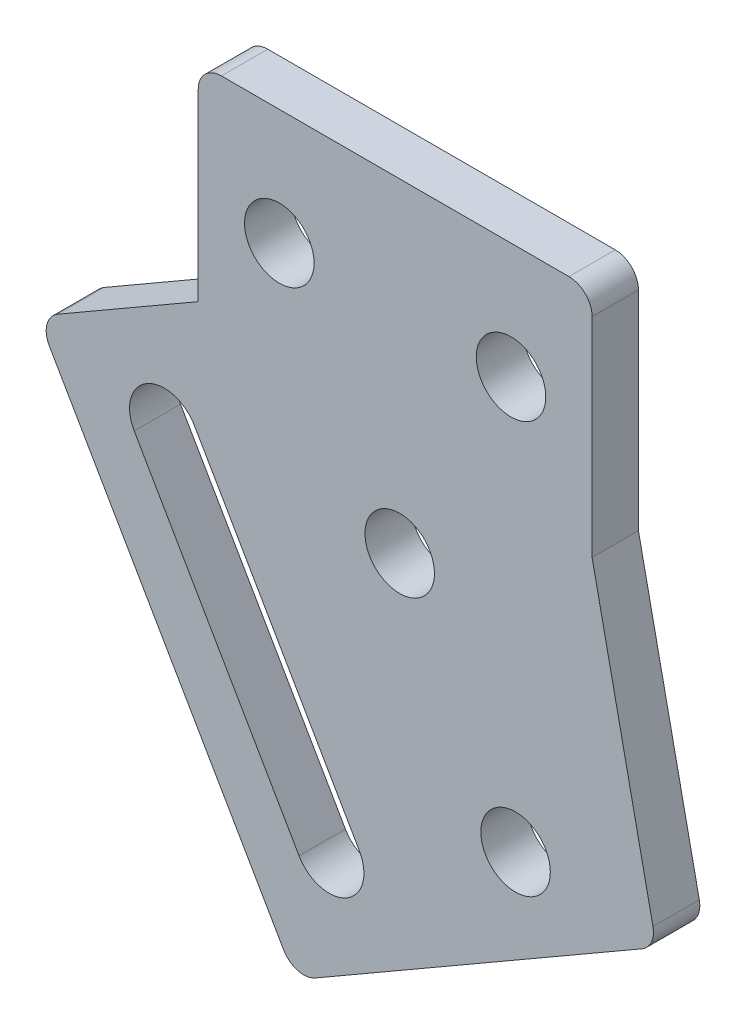
ISO-10303-21;
HEADER;
FILE_DESCRIPTION(('STEP AP214'),'2;1');
FILE_NAME('part.step','',(''),(''),'','','');
FILE_SCHEMA(('AUTOMOTIVE_DESIGN { 1 0 10303 214 1 1 1 1 }'));
ENDSEC;
DATA;
#1=APPLICATION_CONTEXT('core data for automotive mechanical design processes');
#2=APPLICATION_PROTOCOL_DEFINITION('international standard','automotive_design',2000,#1);
#3=PRODUCT_CONTEXT('',#1,'mechanical');
#4=PRODUCT('Part','Part','',(#3));
#5=PRODUCT_RELATED_PRODUCT_CATEGORY('part','',(#4));
#6=PRODUCT_DEFINITION_FORMATION('','',#4);
#7=PRODUCT_DEFINITION_CONTEXT('part definition',#1,'design');
#8=PRODUCT_DEFINITION('design','',#6,#7);
#9=PRODUCT_DEFINITION_SHAPE('','',#8);
#10=(LENGTH_UNIT() NAMED_UNIT(*) SI_UNIT(.MILLI.,.METRE.));
#11=(NAMED_UNIT(*) PLANE_ANGLE_UNIT() SI_UNIT($,.RADIAN.));
#12=(NAMED_UNIT(*) SI_UNIT($,.STERADIAN.) SOLID_ANGLE_UNIT());
#13=UNCERTAINTY_MEASURE_WITH_UNIT(LENGTH_MEASURE(1.E-05),#10,'distance_accuracy_value','');
#14=(GEOMETRIC_REPRESENTATION_CONTEXT(3) GLOBAL_UNCERTAINTY_ASSIGNED_CONTEXT((#13)) GLOBAL_UNIT_ASSIGNED_CONTEXT((#10,
#11,#12)) REPRESENTATION_CONTEXT('',''));
#15=CARTESIAN_POINT('',(0.,0.,0.));
#16=DIRECTION('',(0.,0.,1.));
#17=DIRECTION('',(1.,0.,0.));
#18=AXIS2_PLACEMENT_3D('',#15,#16,#17);
#19=CARTESIAN_POINT('',(0.,0.,2.));
#20=DIRECTION('',(0.,0.,-1.));
#21=DIRECTION('',(-1.,0.,0.));
#22=AXIS2_PLACEMENT_3D('',#19,#20,#21);
#23=PLANE('',#22);
#24=DIRECTION('',(0.5,-0.866025403784439,0.));
#25=VECTOR('',#24,1.);
#26=CARTESIAN_POINT('',(-18.7852540378781,-10.8456714755644,2.));
#27=LINE('',#26,#25);
#28=CARTESIAN_POINT('',(-17.1650635094611,-13.6519237887245,2.));
#29=VERTEX_POINT('',#28);
#30=CARTESIAN_POINT('',(-10.0490381056317,-25.9772413361079,2.));
#31=VERTEX_POINT('',#30);
#32=EDGE_CURVE('E192',#29,#31,#27,.T.);
#33=ORIENTED_EDGE('',*,*,#32,.T.);
#34=CARTESIAN_POINT('',(-11.3480762113083,-26.7272413361079,2.));
#35=DIRECTION('',(0.,0.,-1.));
#36=DIRECTION('',(-1.,0.,0.));
#37=AXIS2_PLACEMENT_3D('',#34,#35,#36);
#38=CIRCLE('',#37,1.5);
#39=CARTESIAN_POINT('',(-12.647114316985,-27.4772413361079,2.));
#40=VERTEX_POINT('',#39);
#41=EDGE_CURVE('E195',#31,#40,#38,.T.);
#42=ORIENTED_EDGE('',*,*,#41,.T.);
#43=DIRECTION('',(-0.5,0.866025403784438,0.));
#44=VECTOR('',#43,1.);
#45=CARTESIAN_POINT('',(-21.3833302492314,-12.3456714755644,2.));
#46=LINE('',#45,#44);
#47=CARTESIAN_POINT('',(-19.7631397208144,-15.1519237887245,2.));
#48=VERTEX_POINT('',#47);
#49=EDGE_CURVE('E187',#40,#48,#46,.T.);
#50=ORIENTED_EDGE('',*,*,#49,.T.);
#51=CARTESIAN_POINT('',(-18.4641016151378,-14.4019237887245,2.));
#52=DIRECTION('',(0.,0.,-1.));
#53=DIRECTION('',(-1.,0.,0.));
#54=AXIS2_PLACEMENT_3D('',#51,#52,#53);
#55=CIRCLE('',#54,1.5);
#56=EDGE_CURVE('E162',#48,#29,#55,.T.);
#57=ORIENTED_EDGE('',*,*,#56,.T.);
#58=EDGE_LOOP('',(#33,#42,#50,#57));
#59=FACE_BOUND('',#58,.T.);
#60=DIRECTION('',(0.866025403784436,0.500000000000004,0.));
#61=VECTOR('',#60,1.);
#62=CARTESIAN_POINT('',(-5.88397459617049,-28.1913429512456,2.));
#63=LINE('',#62,#61);
#64=CARTESIAN_POINT('',(-11.9461524226615,-31.6913429512456,2.));
#65=VERTEX_POINT('',#64);
#66=CARTESIAN_POINT('',(2.14840043724142,-23.5538490634731,2.));
#67=VERTEX_POINT('',#66);
#68=EDGE_CURVE('E245',#65,#67,#63,.T.);
#69=ORIENTED_EDGE('',*,*,#68,.T.);
#70=CARTESIAN_POINT('',(1.64840043724142,-22.6878236596887,2.));
#71=DIRECTION('',(0.,0.,-1.));
#72=DIRECTION('',(-1.,0.,0.));
#73=AXIS2_PLACEMENT_3D('',#70,#71,#72);
#74=CIRCLE('',#73,1.);
#75=CARTESIAN_POINT('',(2.62696286276853,-22.4818732303459,2.));
#76=VERTEX_POINT('',#75);
#77=EDGE_CURVE('E288',#67,#76,#74,.F.);
#78=ORIENTED_EDGE('',*,*,#77,.T.);
#79=DIRECTION('',(-0.205950429342828,0.978562425527112,0.));
#80=VECTOR('',#79,1.);
#81=CARTESIAN_POINT('',(2.77627944167387,-23.1913429512455,2.));
#82=LINE('',#81,#80);
#83=CARTESIAN_POINT('',(0.,-10.0000000001557,2.));
#84=VERTEX_POINT('',#83);
#85=EDGE_CURVE('E233',#76,#84,#82,.T.);
#86=ORIENTED_EDGE('',*,*,#85,.T.);
#87=DIRECTION('',(0.,1.,0.));
#88=VECTOR('',#87,1.);
#89=CARTESIAN_POINT('',(0.,-10.0000000001557,2.));
#90=LINE('',#89,#88);
#91=CARTESIAN_POINT('',(0.,-1.,2.));
#92=VERTEX_POINT('',#91);
#93=EDGE_CURVE('E235',#84,#92,#90,.T.);
#94=ORIENTED_EDGE('',*,*,#93,.T.);
#95=CARTESIAN_POINT('',(-1.,-1.,2.));
#96=DIRECTION('',(0.,0.,-1.));
#97=DIRECTION('',(-1.,0.,0.));
#98=AXIS2_PLACEMENT_3D('',#95,#96,#97);
#99=CIRCLE('',#98,1.);
#100=CARTESIAN_POINT('',(-1.,0.,2.));
#101=VERTEX_POINT('',#100);
#102=EDGE_CURVE('E282',#92,#101,#99,.F.);
#103=ORIENTED_EDGE('',*,*,#102,.T.);
#104=DIRECTION('',(-1.,0.,0.));
#105=VECTOR('',#104,1.);
#106=CARTESIAN_POINT('',(-17.,0.,2.));
#107=LINE('',#106,#105);
#108=CARTESIAN_POINT('',(-16.,0.,2.));
#109=VERTEX_POINT('',#108);
#110=EDGE_CURVE('E239',#101,#109,#107,.T.);
#111=ORIENTED_EDGE('',*,*,#110,.T.);
#112=CARTESIAN_POINT('',(-16.,-1.,2.));
#113=DIRECTION('',(0.,0.,-1.));
#114=DIRECTION('',(-1.,0.,0.));
#115=AXIS2_PLACEMENT_3D('',#112,#113,#114);
#116=CIRCLE('',#115,1.);
#117=CARTESIAN_POINT('',(-17.,-1.,2.));
#118=VERTEX_POINT('',#117);
#119=EDGE_CURVE('E284',#109,#118,#116,.F.);
#120=ORIENTED_EDGE('',*,*,#119,.T.);
#121=DIRECTION('',(0.,-1.,0.));
#122=VECTOR('',#121,1.);
#123=CARTESIAN_POINT('',(-17.,0.,2.));
#124=LINE('',#123,#122);
#125=CARTESIAN_POINT('',(-17.,-8.93782217358676,2.));
#126=VERTEX_POINT('',#125);
#127=EDGE_CURVE('E242',#118,#126,#124,.T.);
#128=ORIENTED_EDGE('',*,*,#127,.T.);
#129=DIRECTION('',(0.866025403784436,0.500000000000005,0.));
#130=VECTOR('',#129,1.);
#131=CARTESIAN_POINT('',(-23.9282032302755,-12.9378221735868,2.));
#132=LINE('',#131,#130);
#133=CARTESIAN_POINT('',(-23.0621778264911,-12.4378221735868,2.));
#134=VERTEX_POINT('',#133);
#135=EDGE_CURVE('E206',#134,#126,#132,.T.);
#136=ORIENTED_EDGE('',*,*,#135,.F.);
#137=CARTESIAN_POINT('',(-22.562177826491,-13.3038475773712,2.));
#138=DIRECTION('',(0.,0.,-1.));
#139=DIRECTION('',(-1.,0.,0.));
#140=AXIS2_PLACEMENT_3D('',#137,#138,#139);
#141=CIRCLE('',#140,1.);
#142=CARTESIAN_POINT('',(-23.4282032302755,-13.8038475773712,2.));
#143=VERTEX_POINT('',#142);
#144=EDGE_CURVE('E54',#134,#143,#141,.F.);
#145=ORIENTED_EDGE('',*,*,#144,.T.);
#146=DIRECTION('',(-0.500000000000005,0.866025403784436,0.));
#147=VECTOR('',#146,1.);
#148=CARTESIAN_POINT('',(-23.9282032302755,-12.9378221735868,2.));
#149=LINE('',#148,#147);
#150=CARTESIAN_POINT('',(-13.312177826446,-31.3253175474612,2.));
#151=VERTEX_POINT('',#150);
#152=EDGE_CURVE('E198',#151,#143,#149,.T.);
#153=ORIENTED_EDGE('',*,*,#152,.F.);
#154=CARTESIAN_POINT('',(-12.4461524226615,-30.8253175474612,2.));
#155=DIRECTION('',(0.,0.,-1.));
#156=DIRECTION('',(-1.,0.,0.));
#157=AXIS2_PLACEMENT_3D('',#154,#155,#156);
#158=CIRCLE('',#157,1.);
#159=EDGE_CURVE('E62',#151,#65,#158,.F.);
#160=ORIENTED_EDGE('',*,*,#159,.T.);
#161=EDGE_LOOP('',(#69,#78,#86,#94,#103,#111,#120,#128,#136,#145,#153,#160));
#162=FACE_BOUND('',#161,.T.);
#163=CARTESIAN_POINT('',(-13.5,-5.00000000007784,2.));
#164=DIRECTION('',(0.,0.,1.));
#165=DIRECTION('',(1.,0.,0.));
#166=AXIS2_PLACEMENT_3D('',#163,#164,#165);
#167=CIRCLE('',#166,1.50000000000003);
#168=CARTESIAN_POINT('',(-12.,-5.00000000007784,2.));
#169=VERTEX_POINT('',#168);
#170=EDGE_CURVE('E227',#169,#169,#167,.T.);
#171=ORIENTED_EDGE('',*,*,#170,.F.);
#172=EDGE_LOOP('',(#171));
#173=FACE_BOUND('',#172,.T.);
#174=CARTESIAN_POINT('',(-8.30384757724837,-14.0000000001557,2.));
#175=DIRECTION('',(0.,0.,1.));
#176=DIRECTION('',(1.,0.,0.));
#177=AXIS2_PLACEMENT_3D('',#174,#175,#176);
#178=CIRCLE('',#177,1.5);
#179=CARTESIAN_POINT('',(-6.80384757724837,-14.0000000001557,2.));
#180=VERTEX_POINT('',#179);
#181=EDGE_CURVE('E221',#180,#180,#178,.T.);
#182=ORIENTED_EDGE('',*,*,#181,.F.);
#183=EDGE_LOOP('',(#182));
#184=FACE_BOUND('',#183,.T.);
#185=CARTESIAN_POINT('',(-3.30384757724832,-22.660254038,2.));
#186=DIRECTION('',(0.,0.,1.));
#187=DIRECTION('',(1.,0.,0.));
#188=AXIS2_PLACEMENT_3D('',#185,#186,#187);
#189=CIRCLE('',#188,1.50000000000001);
#190=CARTESIAN_POINT('',(-1.80384757724831,-22.660254038,2.));
#191=VERTEX_POINT('',#190);
#192=EDGE_CURVE('E215',#191,#191,#189,.T.);
#193=ORIENTED_EDGE('',*,*,#192,.F.);
#194=EDGE_LOOP('',(#193));
#195=FACE_BOUND('',#194,.T.);
#196=CARTESIAN_POINT('',(-3.5,-5.00000000007784,2.));
#197=DIRECTION('',(0.,0.,1.));
#198=DIRECTION('',(1.,0.,0.));
#199=AXIS2_PLACEMENT_3D('',#196,#197,#198);
#200=CIRCLE('',#199,1.50000000000003);
#201=CARTESIAN_POINT('',(-1.99999999999997,-5.00000000007784,2.));
#202=VERTEX_POINT('',#201);
#203=EDGE_CURVE('E209',#202,#202,#200,.T.);
#204=ORIENTED_EDGE('',*,*,#203,.F.);
#205=EDGE_LOOP('',(#204));
#206=FACE_BOUND('',#205,.T.);
#207=ADVANCED_FACE('F39',(#59,#162,#173,#184,#195,#206),#23,.F.);
#208=CARTESIAN_POINT('',(0.,0.,0.));
#209=DIRECTION('',(0.,0.,-1.));
#210=DIRECTION('',(-1.,0.,0.));
#211=AXIS2_PLACEMENT_3D('',#208,#209,#210);
#212=PLANE('',#211);
#213=CARTESIAN_POINT('',(-11.3480762113083,-26.7272413361079,0.));
#214=DIRECTION('',(0.,0.,-1.));
#215=DIRECTION('',(-1.,0.,0.));
#216=AXIS2_PLACEMENT_3D('',#213,#214,#215);
#217=CIRCLE('',#216,1.5);
#218=CARTESIAN_POINT('',(-10.0490381056317,-25.9772413361079,0.));
#219=VERTEX_POINT('',#218);
#220=CARTESIAN_POINT('',(-12.647114316985,-27.4772413361079,0.));
#221=VERTEX_POINT('',#220);
#222=EDGE_CURVE('E175',#219,#221,#217,.T.);
#223=ORIENTED_EDGE('',*,*,#222,.F.);
#224=DIRECTION('',(0.5,-0.866025403784439,0.));
#225=VECTOR('',#224,1.);
#226=CARTESIAN_POINT('',(-10.0490381056317,-25.9772413361079,0.));
#227=LINE('',#226,#225);
#228=CARTESIAN_POINT('',(-17.1650635094611,-13.6519237887245,0.));
#229=VERTEX_POINT('',#228);
#230=EDGE_CURVE('E180',#229,#219,#227,.T.);
#231=ORIENTED_EDGE('',*,*,#230,.F.);
#232=CARTESIAN_POINT('',(-18.4641016151378,-14.4019237887245,0.));
#233=DIRECTION('',(0.,0.,-1.));
#234=DIRECTION('',(-1.,0.,0.));
#235=AXIS2_PLACEMENT_3D('',#232,#233,#234);
#236=CIRCLE('',#235,1.5);
#237=CARTESIAN_POINT('',(-19.7631397208144,-15.1519237887245,0.));
#238=VERTEX_POINT('',#237);
#239=EDGE_CURVE('E159',#238,#229,#236,.T.);
#240=ORIENTED_EDGE('',*,*,#239,.F.);
#241=DIRECTION('',(-0.5,0.866025403784438,0.));
#242=VECTOR('',#241,1.);
#243=CARTESIAN_POINT('',(-12.647114316985,-27.4772413361079,0.));
#244=LINE('',#243,#242);
#245=EDGE_CURVE('E170',#221,#238,#244,.T.);
#246=ORIENTED_EDGE('',*,*,#245,.F.);
#247=EDGE_LOOP('',(#223,#231,#240,#246));
#248=FACE_BOUND('',#247,.T.);
#249=CARTESIAN_POINT('',(-3.30384757724832,-22.660254038,0.));
#250=DIRECTION('',(0.,0.,1.));
#251=DIRECTION('',(1.,0.,0.));
#252=AXIS2_PLACEMENT_3D('',#249,#250,#251);
#253=CIRCLE('',#252,1.50000000000001);
#254=CARTESIAN_POINT('',(-1.80384757724831,-22.660254038,0.));
#255=VERTEX_POINT('',#254);
#256=EDGE_CURVE('E212',#255,#255,#253,.T.);
#257=ORIENTED_EDGE('',*,*,#256,.T.);
#258=EDGE_LOOP('',(#257));
#259=FACE_BOUND('',#258,.T.);
#260=CARTESIAN_POINT('',(-13.5,-5.00000000007784,0.));
#261=DIRECTION('',(0.,0.,1.));
#262=DIRECTION('',(1.,0.,0.));
#263=AXIS2_PLACEMENT_3D('',#260,#261,#262);
#264=CIRCLE('',#263,1.50000000000003);
#265=CARTESIAN_POINT('',(-12.,-5.00000000007784,0.));
#266=VERTEX_POINT('',#265);
#267=EDGE_CURVE('E224',#266,#266,#264,.T.);
#268=ORIENTED_EDGE('',*,*,#267,.T.);
#269=EDGE_LOOP('',(#268));
#270=FACE_BOUND('',#269,.T.);
#271=DIRECTION('',(-0.205950429342828,0.978562425527112,0.));
#272=VECTOR('',#271,1.);
#273=CARTESIAN_POINT('',(2.77627944167387,-23.1913429512455,0.));
#274=LINE('',#273,#272);
#275=CARTESIAN_POINT('',(2.62696286276853,-22.4818732303459,0.));
#276=VERTEX_POINT('',#275);
#277=CARTESIAN_POINT('',(0.,-10.0000000001557,0.));
#278=VERTEX_POINT('',#277);
#279=EDGE_CURVE('E230',#276,#278,#274,.T.);
#280=ORIENTED_EDGE('',*,*,#279,.F.);
#281=CARTESIAN_POINT('',(1.64840043724142,-22.6878236596887,0.));
#282=DIRECTION('',(0.,0.,-1.));
#283=DIRECTION('',(-1.,0.,0.));
#284=AXIS2_PLACEMENT_3D('',#281,#282,#283);
#285=CIRCLE('',#284,1.);
#286=CARTESIAN_POINT('',(2.14840043724142,-23.5538490634731,0.));
#287=VERTEX_POINT('',#286);
#288=EDGE_CURVE('E276',#276,#287,#285,.T.);
#289=ORIENTED_EDGE('',*,*,#288,.T.);
#290=DIRECTION('',(0.866025403784436,0.500000000000004,0.));
#291=VECTOR('',#290,1.);
#292=CARTESIAN_POINT('',(-5.88397459617049,-28.1913429512456,0.));
#293=LINE('',#292,#291);
#294=CARTESIAN_POINT('',(-11.9461524226615,-31.6913429512456,0.));
#295=VERTEX_POINT('',#294);
#296=EDGE_CURVE('E236',#295,#287,#293,.T.);
#297=ORIENTED_EDGE('',*,*,#296,.F.);
#298=CARTESIAN_POINT('',(-12.4461524226615,-30.8253175474612,0.));
#299=DIRECTION('',(0.,0.,-1.));
#300=DIRECTION('',(-1.,0.,0.));
#301=AXIS2_PLACEMENT_3D('',#298,#299,#300);
#302=CIRCLE('',#301,1.);
#303=CARTESIAN_POINT('',(-13.312177826446,-31.3253175474612,0.));
#304=VERTEX_POINT('',#303);
#305=EDGE_CURVE('E274',#295,#304,#302,.T.);
#306=ORIENTED_EDGE('',*,*,#305,.T.);
#307=DIRECTION('',(0.500000000000005,-0.866025403784436,0.));
#308=VECTOR('',#307,1.);
#309=CARTESIAN_POINT('',(-23.9282032302755,-12.9378221735868,0.));
#310=LINE('',#309,#308);
#311=CARTESIAN_POINT('',(-23.4282032302755,-13.8038475773712,0.));
#312=VERTEX_POINT('',#311);
#313=EDGE_CURVE('E200',#312,#304,#310,.T.);
#314=ORIENTED_EDGE('',*,*,#313,.F.);
#315=CARTESIAN_POINT('',(-22.562177826491,-13.3038475773712,0.));
#316=DIRECTION('',(0.,0.,-1.));
#317=DIRECTION('',(-1.,0.,0.));
#318=AXIS2_PLACEMENT_3D('',#315,#316,#317);
#319=CIRCLE('',#318,1.);
#320=CARTESIAN_POINT('',(-23.0621778264911,-12.4378221735868,0.));
#321=VERTEX_POINT('',#320);
#322=EDGE_CURVE('E272',#312,#321,#319,.T.);
#323=ORIENTED_EDGE('',*,*,#322,.T.);
#324=DIRECTION('',(0.866025403784436,0.500000000000005,0.));
#325=VECTOR('',#324,1.);
#326=CARTESIAN_POINT('',(-23.9282032302755,-12.9378221735868,0.));
#327=LINE('',#326,#325);
#328=CARTESIAN_POINT('',(-17.,-8.93782217358676,0.));
#329=VERTEX_POINT('',#328);
#330=EDGE_CURVE('E203',#321,#329,#327,.T.);
#331=ORIENTED_EDGE('',*,*,#330,.T.);
#332=DIRECTION('',(0.,-1.,0.));
#333=VECTOR('',#332,1.);
#334=CARTESIAN_POINT('',(-17.,0.,0.));
#335=LINE('',#334,#333);
#336=CARTESIAN_POINT('',(-17.,-1.,0.));
#337=VERTEX_POINT('',#336);
#338=EDGE_CURVE('E256',#337,#329,#335,.T.);
#339=ORIENTED_EDGE('',*,*,#338,.F.);
#340=CARTESIAN_POINT('',(-16.,-1.,0.));
#341=DIRECTION('',(0.,0.,-1.));
#342=DIRECTION('',(-1.,0.,0.));
#343=AXIS2_PLACEMENT_3D('',#340,#341,#342);
#344=CIRCLE('',#343,1.);
#345=CARTESIAN_POINT('',(-16.,0.,0.));
#346=VERTEX_POINT('',#345);
#347=EDGE_CURVE('E270',#337,#346,#344,.T.);
#348=ORIENTED_EDGE('',*,*,#347,.T.);
#349=DIRECTION('',(-1.,0.,0.));
#350=VECTOR('',#349,1.);
#351=CARTESIAN_POINT('',(-17.,0.,0.));
#352=LINE('',#351,#350);
#353=CARTESIAN_POINT('',(-1.,0.,0.));
#354=VERTEX_POINT('',#353);
#355=EDGE_CURVE('E253',#354,#346,#352,.T.);
#356=ORIENTED_EDGE('',*,*,#355,.F.);
#357=CARTESIAN_POINT('',(-1.,-1.,0.));
#358=DIRECTION('',(0.,0.,-1.));
#359=DIRECTION('',(-1.,0.,0.));
#360=AXIS2_PLACEMENT_3D('',#357,#358,#359);
#361=CIRCLE('',#360,1.);
#362=CARTESIAN_POINT('',(0.,-1.,0.));
#363=VERTEX_POINT('',#362);
#364=EDGE_CURVE('E268',#354,#363,#361,.T.);
#365=ORIENTED_EDGE('',*,*,#364,.T.);
#366=DIRECTION('',(0.,1.,0.));
#367=VECTOR('',#366,1.);
#368=CARTESIAN_POINT('',(0.,-10.0000000001557,0.));
#369=LINE('',#368,#367);
#370=EDGE_CURVE('E250',#278,#363,#369,.T.);
#371=ORIENTED_EDGE('',*,*,#370,.F.);
#372=EDGE_LOOP('',(#280,#289,#297,#306,#314,#323,#331,#339,#348,#356,#365,#371));
#373=FACE_BOUND('',#372,.T.);
#374=CARTESIAN_POINT('',(-8.30384757724837,-14.0000000001557,0.));
#375=DIRECTION('',(0.,0.,1.));
#376=DIRECTION('',(1.,0.,0.));
#377=AXIS2_PLACEMENT_3D('',#374,#375,#376);
#378=CIRCLE('',#377,1.5);
#379=CARTESIAN_POINT('',(-6.80384757724837,-14.0000000001557,0.));
#380=VERTEX_POINT('',#379);
#381=EDGE_CURVE('E218',#380,#380,#378,.T.);
#382=ORIENTED_EDGE('',*,*,#381,.T.);
#383=EDGE_LOOP('',(#382));
#384=FACE_BOUND('',#383,.T.);
#385=CARTESIAN_POINT('',(-3.5,-5.00000000007784,0.));
#386=DIRECTION('',(0.,0.,1.));
#387=DIRECTION('',(1.,0.,0.));
#388=AXIS2_PLACEMENT_3D('',#385,#386,#387);
#389=CIRCLE('',#388,1.50000000000003);
#390=CARTESIAN_POINT('',(-1.99999999999997,-5.00000000007784,0.));
#391=VERTEX_POINT('',#390);
#392=EDGE_CURVE('E208',#391,#391,#389,.T.);
#393=ORIENTED_EDGE('',*,*,#392,.T.);
#394=EDGE_LOOP('',(#393));
#395=FACE_BOUND('',#394,.T.);
#396=ADVANCED_FACE('F177',(#248,#259,#270,#373,#384,#395),#212,.T.);
#397=CARTESIAN_POINT('',(2.77627944167387,-23.1913429512455,2.));
#398=DIRECTION('',(-0.978562425527112,-0.205950429342828,0.));
#399=DIRECTION('',(0.205950429342828,-0.978562425527112,0.));
#400=AXIS2_PLACEMENT_3D('',#397,#398,#399);
#401=PLANE('',#400);
#402=ORIENTED_EDGE('',*,*,#85,.F.);
#403=DIRECTION('',(0.,0.,-1.));
#404=VECTOR('',#403,1.);
#405=CARTESIAN_POINT('',(2.62696286276853,-22.4818732303459,2.));
#406=LINE('',#405,#404);
#407=EDGE_CURVE('E265',#76,#276,#406,.T.);
#408=ORIENTED_EDGE('',*,*,#407,.T.);
#409=ORIENTED_EDGE('',*,*,#279,.T.);
#410=DIRECTION('',(0.,0.,-1.));
#411=VECTOR('',#410,1.);
#412=CARTESIAN_POINT('',(0.,-10.0000000001557,2.));
#413=LINE('',#412,#411);
#414=EDGE_CURVE('E262',#84,#278,#413,.T.);
#415=ORIENTED_EDGE('',*,*,#414,.F.);
#416=EDGE_LOOP('',(#402,#408,#409,#415));
#417=FACE_BOUND('',#416,.T.);
#418=ADVANCED_FACE('F347',(#417),#401,.F.);
#419=CARTESIAN_POINT('',(0.,-10.0000000001557,2.));
#420=DIRECTION('',(-1.,0.,0.));
#421=DIRECTION('',(0.,0.,1.));
#422=AXIS2_PLACEMENT_3D('',#419,#420,#421);
#423=PLANE('',#422);
#424=ORIENTED_EDGE('',*,*,#370,.T.);
#425=DIRECTION('',(0.,0.,-1.));
#426=VECTOR('',#425,1.);
#427=CARTESIAN_POINT('',(0.,-1.,2.));
#428=LINE('',#427,#426);
#429=EDGE_CURVE('E11',#363,#92,#428,.F.);
#430=ORIENTED_EDGE('',*,*,#429,.T.);
#431=ORIENTED_EDGE('',*,*,#93,.F.);
#432=ORIENTED_EDGE('',*,*,#414,.T.);
#433=EDGE_LOOP('',(#424,#430,#431,#432));
#434=FACE_BOUND('',#433,.T.);
#435=ADVANCED_FACE('F350',(#434),#423,.F.);
#436=CARTESIAN_POINT('',(-17.,0.,2.));
#437=DIRECTION('',(0.,-1.,0.));
#438=DIRECTION('',(1.,0.,0.));
#439=AXIS2_PLACEMENT_3D('',#436,#437,#438);
#440=PLANE('',#439);
#441=ORIENTED_EDGE('',*,*,#355,.T.);
#442=DIRECTION('',(0.,0.,-1.));
#443=VECTOR('',#442,1.);
#444=CARTESIAN_POINT('',(-16.,0.,2.));
#445=LINE('',#444,#443);
#446=EDGE_CURVE('E47',#346,#109,#445,.F.);
#447=ORIENTED_EDGE('',*,*,#446,.T.);
#448=ORIENTED_EDGE('',*,*,#110,.F.);
#449=DIRECTION('',(0.,0.,-1.));
#450=VECTOR('',#449,1.);
#451=CARTESIAN_POINT('',(-1.,0.,2.));
#452=LINE('',#451,#450);
#453=EDGE_CURVE('E300',#101,#354,#452,.T.);
#454=ORIENTED_EDGE('',*,*,#453,.T.);
#455=EDGE_LOOP('',(#441,#447,#448,#454));
#456=FACE_BOUND('',#455,.T.);
#457=ADVANCED_FACE('F305',(#456),#440,.F.);
#458=CARTESIAN_POINT('',(-17.,0.,2.));
#459=DIRECTION('',(1.,0.,0.));
#460=DIRECTION('',(0.,0.,-1.));
#461=AXIS2_PLACEMENT_3D('',#458,#459,#460);
#462=PLANE('',#461);
#463=ORIENTED_EDGE('',*,*,#127,.F.);
#464=DIRECTION('',(0.,0.,-1.));
#465=VECTOR('',#464,1.);
#466=CARTESIAN_POINT('',(-17.,-1.,2.));
#467=LINE('',#466,#465);
#468=EDGE_CURVE('E297',#118,#337,#467,.T.);
#469=ORIENTED_EDGE('',*,*,#468,.T.);
#470=ORIENTED_EDGE('',*,*,#338,.T.);
#471=DIRECTION('',(0.,0.,-1.));
#472=VECTOR('',#471,1.);
#473=CARTESIAN_POINT('',(-17.,-8.93782217358675,2.));
#474=LINE('',#473,#472);
#475=EDGE_CURVE('E248',#126,#329,#474,.T.);
#476=ORIENTED_EDGE('',*,*,#475,.F.);
#477=EDGE_LOOP('',(#463,#469,#470,#476));
#478=FACE_BOUND('',#477,.T.);
#479=ADVANCED_FACE('F317',(#478),#462,.F.);
#480=CARTESIAN_POINT('',(-5.88397459617049,-28.1913429512456,2.));
#481=DIRECTION('',(-0.500000000000004,0.866025403784436,0.));
#482=DIRECTION('',(-0.866025403784436,-0.500000000000004,0.));
#483=AXIS2_PLACEMENT_3D('',#480,#481,#482);
#484=PLANE('',#483);
#485=ORIENTED_EDGE('',*,*,#296,.T.);
#486=DIRECTION('',(0.,0.,-1.));
#487=VECTOR('',#486,1.);
#488=CARTESIAN_POINT('',(2.14840043724142,-23.5538490634731,2.));
#489=LINE('',#488,#487);
#490=EDGE_CURVE('E280',#287,#67,#489,.F.);
#491=ORIENTED_EDGE('',*,*,#490,.T.);
#492=ORIENTED_EDGE('',*,*,#68,.F.);
#493=DIRECTION('',(0.,0.,1.));
#494=VECTOR('',#493,1.);
#495=CARTESIAN_POINT('',(-11.9461524226615,-31.6913429512456,2.));
#496=LINE('',#495,#494);
#497=EDGE_CURVE('E278',#65,#295,#496,.F.);
#498=ORIENTED_EDGE('',*,*,#497,.T.);
#499=EDGE_LOOP('',(#485,#491,#492,#498));
#500=FACE_BOUND('',#499,.T.);
#501=ADVANCED_FACE('F338',(#500),#484,.F.);
#502=CARTESIAN_POINT('',(-13.5,-5.00000000007784,2.));
#503=DIRECTION('',(0.,0.,-1.));
#504=DIRECTION('',(-1.,0.,0.));
#505=AXIS2_PLACEMENT_3D('',#502,#503,#504);
#506=CYLINDRICAL_SURFACE('',#505,1.50000000000003);
#507=ORIENTED_EDGE('',*,*,#170,.T.);
#508=EDGE_LOOP('',(#507));
#509=FACE_BOUND('',#508,.T.);
#510=ORIENTED_EDGE('',*,*,#267,.F.);
#511=EDGE_LOOP('',(#510));
#512=FACE_BOUND('',#511,.T.);
#513=ADVANCED_FACE('F366',(#509,#512),#506,.F.);
#514=CARTESIAN_POINT('',(-8.30384757724837,-14.0000000001557,2.));
#515=DIRECTION('',(0.,0.,-1.));
#516=DIRECTION('',(-1.,0.,0.));
#517=AXIS2_PLACEMENT_3D('',#514,#515,#516);
#518=CYLINDRICAL_SURFACE('',#517,1.5);
#519=ORIENTED_EDGE('',*,*,#181,.T.);
#520=EDGE_LOOP('',(#519));
#521=FACE_BOUND('',#520,.T.);
#522=ORIENTED_EDGE('',*,*,#381,.F.);
#523=EDGE_LOOP('',(#522));
#524=FACE_BOUND('',#523,.T.);
#525=ADVANCED_FACE('F488',(#521,#524),#518,.F.);
#526=CARTESIAN_POINT('',(-3.30384757724832,-22.660254038,2.));
#527=DIRECTION('',(0.,0.,-1.));
#528=DIRECTION('',(-1.,0.,0.));
#529=AXIS2_PLACEMENT_3D('',#526,#527,#528);
#530=CYLINDRICAL_SURFACE('',#529,1.50000000000001);
#531=ORIENTED_EDGE('',*,*,#192,.T.);
#532=EDGE_LOOP('',(#531));
#533=FACE_BOUND('',#532,.T.);
#534=ORIENTED_EDGE('',*,*,#256,.F.);
#535=EDGE_LOOP('',(#534));
#536=FACE_BOUND('',#535,.T.);
#537=ADVANCED_FACE('F477',(#533,#536),#530,.F.);
#538=CARTESIAN_POINT('',(-3.5,-5.00000000007784,2.));
#539=DIRECTION('',(0.,0.,-1.));
#540=DIRECTION('',(-1.,0.,0.));
#541=AXIS2_PLACEMENT_3D('',#538,#539,#540);
#542=CYLINDRICAL_SURFACE('',#541,1.50000000000003);
#543=ORIENTED_EDGE('',*,*,#203,.T.);
#544=EDGE_LOOP('',(#543));
#545=FACE_BOUND('',#544,.T.);
#546=ORIENTED_EDGE('',*,*,#392,.F.);
#547=EDGE_LOOP('',(#546));
#548=FACE_BOUND('',#547,.T.);
#549=ADVANCED_FACE('F467',(#545,#548),#542,.F.);
#550=CARTESIAN_POINT('',(-23.9282032302755,-12.9378221735868,2.));
#551=DIRECTION('',(0.500000000000005,-0.866025403784436,0.));
#552=DIRECTION('',(0.866025403784436,0.500000000000005,0.));
#553=AXIS2_PLACEMENT_3D('',#550,#551,#552);
#554=PLANE('',#553);
#555=ORIENTED_EDGE('',*,*,#330,.F.);
#556=DIRECTION('',(0.,0.,-1.));
#557=VECTOR('',#556,1.);
#558=CARTESIAN_POINT('',(-23.0621778264911,-12.4378221735868,2.));
#559=LINE('',#558,#557);
#560=EDGE_CURVE('E295',#321,#134,#559,.F.);
#561=ORIENTED_EDGE('',*,*,#560,.T.);
#562=ORIENTED_EDGE('',*,*,#135,.T.);
#563=ORIENTED_EDGE('',*,*,#475,.T.);
#564=EDGE_LOOP('',(#555,#561,#562,#563));
#565=FACE_BOUND('',#564,.T.);
#566=ADVANCED_FACE('F326',(#565),#554,.F.);
#567=CARTESIAN_POINT('',(-23.5483937586924,-13.5956714755645,0.));
#568=DIRECTION('',(0.866025403784436,0.500000000000005,0.));
#569=DIRECTION('',(-0.500000000000005,0.866025403784436,0.));
#570=AXIS2_PLACEMENT_3D('',#567,#568,#569);
#571=PLANE('',#570);
#572=ORIENTED_EDGE('',*,*,#313,.T.);
#573=DIRECTION('',(0.,0.,1.));
#574=VECTOR('',#573,1.);
#575=CARTESIAN_POINT('',(-13.312177826446,-31.3253175474612,0.));
#576=LINE('',#575,#574);
#577=EDGE_CURVE('E293',#304,#151,#576,.T.);
#578=ORIENTED_EDGE('',*,*,#577,.T.);
#579=ORIENTED_EDGE('',*,*,#152,.T.);
#580=DIRECTION('',(0.,0.,-1.));
#581=VECTOR('',#580,1.);
#582=CARTESIAN_POINT('',(-23.4282032302755,-13.8038475773712,0.));
#583=LINE('',#582,#581);
#584=EDGE_CURVE('E290',#143,#312,#583,.T.);
#585=ORIENTED_EDGE('',*,*,#584,.T.);
#586=EDGE_LOOP('',(#572,#578,#579,#585));
#587=FACE_BOUND('',#586,.T.);
#588=ADVANCED_FACE('F331',(#587),#571,.F.);
#589=CARTESIAN_POINT('',(-11.3480762113083,-26.7272413361079,5.));
#590=DIRECTION('',(0.,0.,-1.));
#591=DIRECTION('',(-1.,0.,0.));
#592=AXIS2_PLACEMENT_3D('',#589,#590,#591);
#593=CYLINDRICAL_SURFACE('',#592,1.5);
#594=DIRECTION('',(0.,0.,-1.));
#595=VECTOR('',#594,1.);
#596=CARTESIAN_POINT('',(-10.0490381056317,-25.9772413361079,5.));
#597=LINE('',#596,#595);
#598=EDGE_CURVE('E185',#31,#219,#597,.T.);
#599=ORIENTED_EDGE('',*,*,#598,.T.);
#600=ORIENTED_EDGE('',*,*,#222,.T.);
#601=DIRECTION('',(0.,0.,-1.));
#602=VECTOR('',#601,1.);
#603=CARTESIAN_POINT('',(-12.647114316985,-27.4772413361079,5.));
#604=LINE('',#603,#602);
#605=EDGE_CURVE('E166',#40,#221,#604,.T.);
#606=ORIENTED_EDGE('',*,*,#605,.F.);
#607=ORIENTED_EDGE('',*,*,#41,.F.);
#608=EDGE_LOOP('',(#599,#600,#606,#607));
#609=FACE_BOUND('',#608,.T.);
#610=ADVANCED_FACE('F440',(#609),#593,.F.);
#611=CARTESIAN_POINT('',(-10.0490381056317,-25.9772413361079,5.));
#612=DIRECTION('',(0.866025403784439,0.5,0.));
#613=DIRECTION('',(-0.5,0.866025403784439,0.));
#614=AXIS2_PLACEMENT_3D('',#611,#612,#613);
#615=PLANE('',#614);
#616=DIRECTION('',(0.,0.,-1.));
#617=VECTOR('',#616,1.);
#618=CARTESIAN_POINT('',(-17.1650635094611,-13.6519237887245,5.));
#619=LINE('',#618,#617);
#620=EDGE_CURVE('E165',#29,#229,#619,.T.);
#621=ORIENTED_EDGE('',*,*,#620,.T.);
#622=ORIENTED_EDGE('',*,*,#230,.T.);
#623=ORIENTED_EDGE('',*,*,#598,.F.);
#624=ORIENTED_EDGE('',*,*,#32,.F.);
#625=EDGE_LOOP('',(#621,#622,#623,#624));
#626=FACE_BOUND('',#625,.T.);
#627=ADVANCED_FACE('F431',(#626),#615,.F.);
#628=CARTESIAN_POINT('',(-18.4641016151378,-14.4019237887245,5.));
#629=DIRECTION('',(0.,0.,-1.));
#630=DIRECTION('',(-1.,0.,0.));
#631=AXIS2_PLACEMENT_3D('',#628,#629,#630);
#632=CYLINDRICAL_SURFACE('',#631,1.5);
#633=DIRECTION('',(0.,0.,-1.));
#634=VECTOR('',#633,1.);
#635=CARTESIAN_POINT('',(-19.7631397208144,-15.1519237887245,5.));
#636=LINE('',#635,#634);
#637=EDGE_CURVE('E154',#48,#238,#636,.T.);
#638=ORIENTED_EDGE('',*,*,#637,.T.);
#639=ORIENTED_EDGE('',*,*,#239,.T.);
#640=ORIENTED_EDGE('',*,*,#620,.F.);
#641=ORIENTED_EDGE('',*,*,#56,.F.);
#642=EDGE_LOOP('',(#638,#639,#640,#641));
#643=FACE_BOUND('',#642,.T.);
#644=ADVANCED_FACE('F156',(#643),#632,.F.);
#645=CARTESIAN_POINT('',(-12.647114316985,-27.4772413361079,5.));
#646=DIRECTION('',(-0.866025403784438,-0.5,0.));
#647=DIRECTION('',(0.5,-0.866025403784438,0.));
#648=AXIS2_PLACEMENT_3D('',#645,#646,#647);
#649=PLANE('',#648);
#650=ORIENTED_EDGE('',*,*,#605,.T.);
#651=ORIENTED_EDGE('',*,*,#245,.T.);
#652=ORIENTED_EDGE('',*,*,#637,.F.);
#653=ORIENTED_EDGE('',*,*,#49,.F.);
#654=EDGE_LOOP('',(#650,#651,#652,#653));
#655=FACE_BOUND('',#654,.T.);
#656=ADVANCED_FACE('F171',(#655),#649,.F.);
#657=CARTESIAN_POINT('',(1.64840043724142,-22.6878236596887,2.));
#658=DIRECTION('',(0.,0.,-1.));
#659=DIRECTION('',(-1.,0.,0.));
#660=AXIS2_PLACEMENT_3D('',#657,#658,#659);
#661=CYLINDRICAL_SURFACE('',#660,1.);
#662=ORIENTED_EDGE('',*,*,#77,.F.);
#663=ORIENTED_EDGE('',*,*,#490,.F.);
#664=ORIENTED_EDGE('',*,*,#288,.F.);
#665=ORIENTED_EDGE('',*,*,#407,.F.);
#666=EDGE_LOOP('',(#662,#663,#664,#665));
#667=FACE_BOUND('',#666,.T.);
#668=ADVANCED_FACE('F341',(#667),#661,.T.);
#669=CARTESIAN_POINT('',(-12.4461524226615,-30.8253175474612,0.));
#670=DIRECTION('',(0.,0.,1.));
#671=DIRECTION('',(1.,0.,0.));
#672=AXIS2_PLACEMENT_3D('',#669,#670,#671);
#673=CYLINDRICAL_SURFACE('',#672,1.);
#674=ORIENTED_EDGE('',*,*,#305,.F.);
#675=ORIENTED_EDGE('',*,*,#497,.F.);
#676=ORIENTED_EDGE('',*,*,#159,.F.);
#677=ORIENTED_EDGE('',*,*,#577,.F.);
#678=EDGE_LOOP('',(#674,#675,#676,#677));
#679=FACE_BOUND('',#678,.T.);
#680=ADVANCED_FACE('F334',(#679),#673,.T.);
#681=CARTESIAN_POINT('',(-22.562177826491,-13.3038475773712,0.));
#682=DIRECTION('',(0.,0.,-1.));
#683=DIRECTION('',(-1.,0.,0.));
#684=AXIS2_PLACEMENT_3D('',#681,#682,#683);
#685=CYLINDRICAL_SURFACE('',#684,1.);
#686=ORIENTED_EDGE('',*,*,#144,.F.);
#687=ORIENTED_EDGE('',*,*,#560,.F.);
#688=ORIENTED_EDGE('',*,*,#322,.F.);
#689=ORIENTED_EDGE('',*,*,#584,.F.);
#690=EDGE_LOOP('',(#686,#687,#688,#689));
#691=FACE_BOUND('',#690,.T.);
#692=ADVANCED_FACE('F329',(#691),#685,.T.);
#693=CARTESIAN_POINT('',(-16.,-1.,2.));
#694=DIRECTION('',(0.,0.,-1.));
#695=DIRECTION('',(-1.,0.,0.));
#696=AXIS2_PLACEMENT_3D('',#693,#694,#695);
#697=CYLINDRICAL_SURFACE('',#696,1.);
#698=ORIENTED_EDGE('',*,*,#119,.F.);
#699=ORIENTED_EDGE('',*,*,#446,.F.);
#700=ORIENTED_EDGE('',*,*,#347,.F.);
#701=ORIENTED_EDGE('',*,*,#468,.F.);
#702=EDGE_LOOP('',(#698,#699,#700,#701));
#703=FACE_BOUND('',#702,.T.);
#704=ADVANCED_FACE('F314',(#703),#697,.T.);
#705=CARTESIAN_POINT('',(-1.,-1.,2.));
#706=DIRECTION('',(0.,0.,-1.));
#707=DIRECTION('',(-1.,0.,0.));
#708=AXIS2_PLACEMENT_3D('',#705,#706,#707);
#709=CYLINDRICAL_SURFACE('',#708,1.);
#710=ORIENTED_EDGE('',*,*,#102,.F.);
#711=ORIENTED_EDGE('',*,*,#429,.F.);
#712=ORIENTED_EDGE('',*,*,#364,.F.);
#713=ORIENTED_EDGE('',*,*,#453,.F.);
#714=EDGE_LOOP('',(#710,#711,#712,#713));
#715=FACE_BOUND('',#714,.T.);
#716=ADVANCED_FACE('F41',(#715),#709,.T.);
#717=CLOSED_SHELL('',(#207,#396,#418,#435,#457,#479,#501,#513,#525,#537,#549,#566,#588,#610,
#627,#644,#656,#668,#680,#692,#704,#716));
#718=MANIFOLD_SOLID_BREP('B2',#717);
#719=ADVANCED_BREP_SHAPE_REPRESENTATION('',(#18,#718),#14);
#720=SHAPE_DEFINITION_REPRESENTATION(#9,#719);
ENDSEC;
END-ISO-10303-21;
